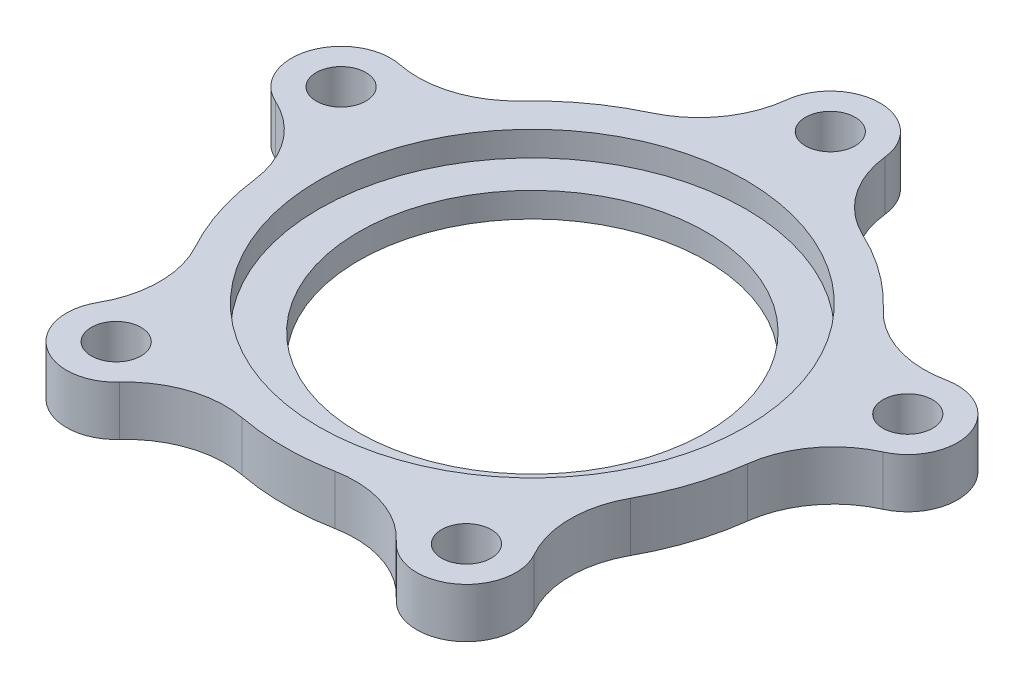
ISO-10303-21;
HEADER;
FILE_DESCRIPTION(('STEP AP214'),'2;1');
FILE_NAME('part.step','',(''),(''),'','','');
FILE_SCHEMA(('AUTOMOTIVE_DESIGN { 1 0 10303 214 1 1 1 1 }'));
ENDSEC;
DATA;
#1=APPLICATION_CONTEXT('core data for automotive mechanical design processes');
#2=APPLICATION_PROTOCOL_DEFINITION('international standard','automotive_design',2000,#1);
#3=PRODUCT_CONTEXT('',#1,'mechanical');
#4=PRODUCT('Part','Part','',(#3));
#5=PRODUCT_RELATED_PRODUCT_CATEGORY('part','',(#4));
#6=PRODUCT_DEFINITION_FORMATION('','',#4);
#7=PRODUCT_DEFINITION_CONTEXT('part definition',#1,'design');
#8=PRODUCT_DEFINITION('design','',#6,#7);
#9=PRODUCT_DEFINITION_SHAPE('','',#8);
#10=(LENGTH_UNIT() NAMED_UNIT(*) SI_UNIT(.MILLI.,.METRE.));
#11=(NAMED_UNIT(*) PLANE_ANGLE_UNIT() SI_UNIT($,.RADIAN.));
#12=(NAMED_UNIT(*) SI_UNIT($,.STERADIAN.) SOLID_ANGLE_UNIT());
#13=UNCERTAINTY_MEASURE_WITH_UNIT(LENGTH_MEASURE(1.E-05),#10,'distance_accuracy_value','');
#14=(GEOMETRIC_REPRESENTATION_CONTEXT(3) GLOBAL_UNCERTAINTY_ASSIGNED_CONTEXT((#13)) GLOBAL_UNIT_ASSIGNED_CONTEXT((#10,
#11,#12)) REPRESENTATION_CONTEXT('',''));
#15=CARTESIAN_POINT('',(0.,0.,0.));
#16=DIRECTION('',(0.,0.,1.));
#17=DIRECTION('',(1.,0.,0.));
#18=AXIS2_PLACEMENT_3D('',#15,#16,#17);
#19=CARTESIAN_POINT('',(0.,6.35,0.));
#20=DIRECTION('',(0.,-1.,0.));
#21=DIRECTION('',(0.,0.,-1.));
#22=AXIS2_PLACEMENT_3D('',#19,#20,#21);
#23=CYLINDRICAL_SURFACE('',#22,31.75);
#24=CARTESIAN_POINT('',(0.,0.,0.));
#25=DIRECTION('',(0.,1.,0.));
#26=DIRECTION('',(0.,0.,1.));
#27=AXIS2_PLACEMENT_3D('',#24,#25,#26);
#28=CIRCLE('',#27,31.75);
#29=CARTESIAN_POINT('',(-5.94458548380077,0.,31.1885299978339));
#30=VERTEX_POINT('',#29);
#31=CARTESIAN_POINT('',(5.94458548380077,0.,31.1885299978339));
#32=VERTEX_POINT('',#31);
#33=EDGE_CURVE('E238',#30,#32,#28,.T.);
#34=ORIENTED_EDGE('',*,*,#33,.T.);
#35=DIRECTION('',(0.,-1.,0.));
#36=VECTOR('',#35,1.);
#37=CARTESIAN_POINT('',(5.94458548380077,6.35,31.1885299978339));
#38=LINE('',#37,#36);
#39=CARTESIAN_POINT('',(5.94458548380077,6.35,31.1885299978339));
#40=VERTEX_POINT('',#39);
#41=EDGE_CURVE('E322',#32,#40,#38,.F.);
#42=ORIENTED_EDGE('',*,*,#41,.T.);
#43=CARTESIAN_POINT('',(0.,6.35,0.));
#44=DIRECTION('',(0.,1.,0.));
#45=DIRECTION('',(0.,0.,1.));
#46=AXIS2_PLACEMENT_3D('',#43,#44,#45);
#47=CIRCLE('',#46,31.75);
#48=CARTESIAN_POINT('',(-5.94458548380077,6.35,31.1885299978339));
#49=VERTEX_POINT('',#48);
#50=EDGE_CURVE('E293',#49,#40,#47,.T.);
#51=ORIENTED_EDGE('',*,*,#50,.F.);
#52=DIRECTION('',(0.,-1.,0.));
#53=VECTOR('',#52,1.);
#54=CARTESIAN_POINT('',(-5.94458548380077,6.35,31.1885299978339));
#55=LINE('',#54,#53);
#56=EDGE_CURVE('E319',#49,#30,#55,.T.);
#57=ORIENTED_EDGE('',*,*,#56,.T.);
#58=EDGE_LOOP('',(#34,#42,#51,#57));
#59=FACE_BOUND('',#58,.T.);
#60=ADVANCED_FACE('F53',(#59),#23,.T.);
#61=CARTESIAN_POINT('',(22.3946181123432,6.35,30.8235474856855));
#62=DIRECTION('',(0.,-1.,0.));
#63=DIRECTION('',(0.,0.,-1.));
#64=AXIS2_PLACEMENT_3D('',#61,#62,#63);
#65=CYLINDRICAL_SURFACE('',#64,6.35);
#66=CARTESIAN_POINT('',(22.3946181123432,0.,30.8235474856855));
#67=DIRECTION('',(0.,1.,0.));
#68=DIRECTION('',(0.,0.,1.));
#69=AXIS2_PLACEMENT_3D('',#66,#67,#68);
#70=CIRCLE('',#69,6.35);
#71=CARTESIAN_POINT('',(17.7038853006692,0.,35.1036789894462));
#72=VERTEX_POINT('',#71);
#73=CARTESIAN_POINT('',(27.9147812244744,0.,27.685028851765));
#74=VERTEX_POINT('',#73);
#75=EDGE_CURVE('E237',#72,#74,#70,.T.);
#76=ORIENTED_EDGE('',*,*,#75,.T.);
#77=DIRECTION('',(0.,-1.,0.));
#78=VECTOR('',#77,1.);
#79=CARTESIAN_POINT('',(27.9147812244744,6.35,27.685028851765));
#80=LINE('',#79,#78);
#81=CARTESIAN_POINT('',(27.9147812244744,6.35,27.685028851765));
#82=VERTEX_POINT('',#81);
#83=EDGE_CURVE('E316',#74,#82,#80,.F.);
#84=ORIENTED_EDGE('',*,*,#83,.T.);
#85=CARTESIAN_POINT('',(22.3946181123432,6.35,30.8235474856855));
#86=DIRECTION('',(0.,1.,0.));
#87=DIRECTION('',(0.,0.,1.));
#88=AXIS2_PLACEMENT_3D('',#85,#86,#87);
#89=CIRCLE('',#88,6.35);
#90=CARTESIAN_POINT('',(17.7038853006692,6.35,35.1036789894462));
#91=VERTEX_POINT('',#90);
#92=EDGE_CURVE('E456',#91,#82,#89,.T.);
#93=ORIENTED_EDGE('',*,*,#92,.F.);
#94=DIRECTION('',(0.,-1.,0.));
#95=VECTOR('',#94,1.);
#96=CARTESIAN_POINT('',(17.7038853006692,6.35,35.1036789894462));
#97=LINE('',#96,#95);
#98=EDGE_CURVE('E312',#91,#72,#97,.T.);
#99=ORIENTED_EDGE('',*,*,#98,.T.);
#100=EDGE_LOOP('',(#76,#84,#93,#99));
#101=FACE_BOUND('',#100,.T.);
#102=ADVANCED_FACE('F483',(#101),#65,.T.);
#103=CARTESIAN_POINT('',(27.8250767490978,0.,15.2914225599458));
#104=VERTEX_POINT('',#103);
#105=CARTESIAN_POINT('',(31.4990326271159,0.,3.98414903786122));
#106=VERTEX_POINT('',#105);
#107=EDGE_CURVE('E224',#104,#106,#28,.T.);
#108=ORIENTED_EDGE('',*,*,#107,.T.);
#109=DIRECTION('',(0.,-1.,0.));
#110=VECTOR('',#109,1.);
#111=CARTESIAN_POINT('',(31.4990326271159,6.35,3.98414903786122));
#112=LINE('',#111,#110);
#113=CARTESIAN_POINT('',(31.4990326271159,6.35,3.98414903786122));
#114=VERTEX_POINT('',#113);
#115=EDGE_CURVE('E309',#106,#114,#112,.F.);
#116=ORIENTED_EDGE('',*,*,#115,.T.);
#117=CARTESIAN_POINT('',(27.8250767490978,6.35,15.2914225599458));
#118=VERTEX_POINT('',#117);
#119=EDGE_CURVE('E450',#118,#114,#47,.T.);
#120=ORIENTED_EDGE('',*,*,#119,.F.);
#121=DIRECTION('',(0.,-1.,0.));
#122=VECTOR('',#121,1.);
#123=CARTESIAN_POINT('',(27.8250767490978,6.35,15.2914225599458));
#124=LINE('',#123,#122);
#125=EDGE_CURVE('E306',#118,#104,#124,.T.);
#126=ORIENTED_EDGE('',*,*,#125,.T.);
#127=EDGE_LOOP('',(#108,#116,#120,#126));
#128=FACE_BOUND('',#127,.T.);
#129=ADVANCED_FACE('F485',(#128),#23,.T.);
#130=CARTESIAN_POINT('',(36.2352532708454,6.35,-11.7735474856855));
#131=DIRECTION('',(0.,-1.,0.));
#132=DIRECTION('',(0.,0.,-1.));
#133=AXIS2_PLACEMENT_3D('',#130,#131,#132);
#134=CYLINDRICAL_SURFACE('',#133,6.35);
#135=CARTESIAN_POINT('',(36.2352532708454,0.,-11.7735474856855));
#136=DIRECTION('',(0.,1.,0.));
#137=DIRECTION('',(0.,0.,1.));
#138=AXIS2_PLACEMENT_3D('',#135,#136,#137);
#139=CIRCLE('',#138,6.35);
#140=CARTESIAN_POINT('',(38.8563840732176,0.,-5.98976210612177));
#141=VERTEX_POINT('',#140);
#142=CARTESIAN_POINT('',(34.9561688859118,0.,-17.9933901795339));
#143=VERTEX_POINT('',#142);
#144=EDGE_CURVE('E221',#141,#143,#139,.T.);
#145=ORIENTED_EDGE('',*,*,#144,.T.);
#146=DIRECTION('',(0.,-1.,0.));
#147=VECTOR('',#146,1.);
#148=CARTESIAN_POINT('',(34.9561688859118,6.35,-17.9933901795339));
#149=LINE('',#148,#147);
#150=CARTESIAN_POINT('',(34.9561688859118,6.35,-17.9933901795339));
#151=VERTEX_POINT('',#150);
#152=EDGE_CURVE('E196',#143,#151,#149,.F.);
#153=ORIENTED_EDGE('',*,*,#152,.T.);
#154=CARTESIAN_POINT('',(36.2352532708454,6.35,-11.7735474856855));
#155=DIRECTION('',(0.,1.,0.));
#156=DIRECTION('',(0.,0.,1.));
#157=AXIS2_PLACEMENT_3D('',#154,#155,#156);
#158=CIRCLE('',#157,6.35);
#159=CARTESIAN_POINT('',(38.8563840732176,6.35,-5.98976210612177));
#160=VERTEX_POINT('',#159);
#161=EDGE_CURVE('E449',#160,#151,#158,.T.);
#162=ORIENTED_EDGE('',*,*,#161,.F.);
#163=DIRECTION('',(0.,-1.,0.));
#164=VECTOR('',#163,1.);
#165=CARTESIAN_POINT('',(38.8563840732176,6.35,-5.98976210612177));
#166=LINE('',#165,#164);
#167=EDGE_CURVE('E212',#160,#141,#166,.T.);
#168=ORIENTED_EDGE('',*,*,#167,.T.);
#169=EDGE_LOOP('',(#145,#153,#162,#168));
#170=FACE_BOUND('',#169,.T.);
#171=ADVANCED_FACE('F495',(#170),#134,.T.);
#172=CARTESIAN_POINT('',(23.1414286543176,6.35,-21.7379111194505));
#173=VERTEX_POINT('',#172);
#174=CARTESIAN_POINT('',(13.5228872924987,6.35,-28.7261904761905));
#175=VERTEX_POINT('',#174);
#176=EDGE_CURVE('E210',#173,#175,#47,.T.);
#177=ORIENTED_EDGE('',*,*,#176,.F.);
#178=DIRECTION('',(0.,-1.,0.));
#179=VECTOR('',#178,1.);
#180=CARTESIAN_POINT('',(23.1414286543176,6.35,-21.7379111194505));
#181=LINE('',#180,#179);
#182=CARTESIAN_POINT('',(23.1414286543176,0.,-21.7379111194505));
#183=VERTEX_POINT('',#182);
#184=EDGE_CURVE('E195',#173,#183,#181,.T.);
#185=ORIENTED_EDGE('',*,*,#184,.T.);
#186=CARTESIAN_POINT('',(13.5228872924987,0.,-28.7261904761905));
#187=VERTEX_POINT('',#186);
#188=EDGE_CURVE('E208',#183,#187,#28,.T.);
#189=ORIENTED_EDGE('',*,*,#188,.T.);
#190=DIRECTION('',(0.,-1.,0.));
#191=VECTOR('',#190,1.);
#192=CARTESIAN_POINT('',(13.5228872924987,6.35,-28.7261904761905));
#193=LINE('',#192,#191);
#194=EDGE_CURVE('E213',#187,#175,#193,.F.);
#195=ORIENTED_EDGE('',*,*,#194,.T.);
#196=EDGE_LOOP('',(#177,#185,#189,#195));
#197=FACE_BOUND('',#196,.T.);
#198=ADVANCED_FACE('F207',(#197),#23,.T.);
#199=CARTESIAN_POINT('',(0.,6.35,-38.1));
#200=DIRECTION('',(0.,-1.,0.));
#201=DIRECTION('',(0.,0.,-1.));
#202=AXIS2_PLACEMENT_3D('',#199,#200,#201);
#203=CYLINDRICAL_SURFACE('',#202,6.35);
#204=CARTESIAN_POINT('',(0.,0.,-38.1));
#205=DIRECTION('',(0.,1.,0.));
#206=DIRECTION('',(0.,0.,1.));
#207=AXIS2_PLACEMENT_3D('',#204,#205,#206);
#208=CIRCLE('',#207,6.35);
#209=CARTESIAN_POINT('',(6.31068073649941,0.,-38.8055555555556));
#210=VERTEX_POINT('',#209);
#211=CARTESIAN_POINT('',(-6.31068073649941,0.,-38.8055555555556));
#212=VERTEX_POINT('',#211);
#213=EDGE_CURVE('E220',#210,#212,#208,.T.);
#214=ORIENTED_EDGE('',*,*,#213,.T.);
#215=DIRECTION('',(0.,-1.,0.));
#216=VECTOR('',#215,1.);
#217=CARTESIAN_POINT('',(-6.31068073649941,6.35,-38.8055555555556));
#218=LINE('',#217,#216);
#219=CARTESIAN_POINT('',(-6.31068073649941,6.35,-38.8055555555556));
#220=VERTEX_POINT('',#219);
#221=EDGE_CURVE('E69',#212,#220,#218,.F.);
#222=ORIENTED_EDGE('',*,*,#221,.T.);
#223=CARTESIAN_POINT('',(0.,6.35,-38.1));
#224=DIRECTION('',(0.,1.,0.));
#225=DIRECTION('',(0.,0.,1.));
#226=AXIS2_PLACEMENT_3D('',#223,#224,#225);
#227=CIRCLE('',#226,6.35);
#228=CARTESIAN_POINT('',(6.31068073649941,6.35,-38.8055555555556));
#229=VERTEX_POINT('',#228);
#230=EDGE_CURVE('E445',#229,#220,#227,.T.);
#231=ORIENTED_EDGE('',*,*,#230,.F.);
#232=DIRECTION('',(0.,-1.,0.));
#233=VECTOR('',#232,1.);
#234=CARTESIAN_POINT('',(6.31068073649941,6.35,-38.8055555555556));
#235=LINE('',#234,#233);
#236=EDGE_CURVE('E351',#229,#210,#235,.T.);
#237=ORIENTED_EDGE('',*,*,#236,.T.);
#238=EDGE_LOOP('',(#214,#222,#231,#237));
#239=FACE_BOUND('',#238,.T.);
#240=ADVANCED_FACE('F507',(#239),#203,.T.);
#241=CARTESIAN_POINT('',(-13.5228872924987,0.,-28.7261904761905));
#242=VERTEX_POINT('',#241);
#243=CARTESIAN_POINT('',(-23.1414286543176,0.,-21.7379111194505));
#244=VERTEX_POINT('',#243);
#245=EDGE_CURVE('E223',#242,#244,#28,.T.);
#246=ORIENTED_EDGE('',*,*,#245,.T.);
#247=DIRECTION('',(0.,-1.,0.));
#248=VECTOR('',#247,1.);
#249=CARTESIAN_POINT('',(-23.1414286543176,6.35,-21.7379111194505));
#250=LINE('',#249,#248);
#251=CARTESIAN_POINT('',(-23.1414286543176,6.35,-21.7379111194505));
#252=VERTEX_POINT('',#251);
#253=EDGE_CURVE('E348',#244,#252,#250,.F.);
#254=ORIENTED_EDGE('',*,*,#253,.T.);
#255=CARTESIAN_POINT('',(-13.5228872924987,6.35,-28.7261904761905));
#256=VERTEX_POINT('',#255);
#257=EDGE_CURVE('E439',#256,#252,#47,.T.);
#258=ORIENTED_EDGE('',*,*,#257,.F.);
#259=DIRECTION('',(0.,-1.,0.));
#260=VECTOR('',#259,1.);
#261=CARTESIAN_POINT('',(-13.5228872924987,6.35,-28.7261904761905));
#262=LINE('',#261,#260);
#263=EDGE_CURVE('E344',#256,#242,#262,.T.);
#264=ORIENTED_EDGE('',*,*,#263,.T.);
#265=EDGE_LOOP('',(#246,#254,#258,#264));
#266=FACE_BOUND('',#265,.T.);
#267=ADVANCED_FACE('F499',(#266),#23,.T.);
#268=CARTESIAN_POINT('',(-36.2352532708454,6.35,-11.7735474856855));
#269=DIRECTION('',(0.,-1.,0.));
#270=DIRECTION('',(0.,0.,-1.));
#271=AXIS2_PLACEMENT_3D('',#268,#269,#270);
#272=CYLINDRICAL_SURFACE('',#271,6.35);
#273=CARTESIAN_POINT('',(-36.2352532708454,0.,-11.7735474856855));
#274=DIRECTION('',(0.,1.,0.));
#275=DIRECTION('',(0.,0.,1.));
#276=AXIS2_PLACEMENT_3D('',#273,#274,#275);
#277=CIRCLE('',#276,6.35);
#278=CARTESIAN_POINT('',(-34.9561688859118,0.,-17.9933901795339));
#279=VERTEX_POINT('',#278);
#280=CARTESIAN_POINT('',(-38.8563840732176,0.,-5.98976210612175));
#281=VERTEX_POINT('',#280);
#282=EDGE_CURVE('E233',#279,#281,#277,.T.);
#283=ORIENTED_EDGE('',*,*,#282,.T.);
#284=DIRECTION('',(0.,-1.,0.));
#285=VECTOR('',#284,1.);
#286=CARTESIAN_POINT('',(-38.8563840732176,6.35,-5.98976210612175));
#287=LINE('',#286,#285);
#288=CARTESIAN_POINT('',(-38.8563840732176,6.35,-5.98976210612175));
#289=VERTEX_POINT('',#288);
#290=EDGE_CURVE('E341',#281,#289,#287,.F.);
#291=ORIENTED_EDGE('',*,*,#290,.T.);
#292=CARTESIAN_POINT('',(-36.2352532708454,6.35,-11.7735474856855));
#293=DIRECTION('',(0.,1.,0.));
#294=DIRECTION('',(0.,0.,1.));
#295=AXIS2_PLACEMENT_3D('',#292,#293,#294);
#296=CIRCLE('',#295,6.35);
#297=CARTESIAN_POINT('',(-34.9561688859118,6.35,-17.9933901795339));
#298=VERTEX_POINT('',#297);
#299=EDGE_CURVE('E437',#298,#289,#296,.T.);
#300=ORIENTED_EDGE('',*,*,#299,.F.);
#301=DIRECTION('',(0.,-1.,0.));
#302=VECTOR('',#301,1.);
#303=CARTESIAN_POINT('',(-34.9561688859118,6.35,-17.9933901795339));
#304=LINE('',#303,#302);
#305=EDGE_CURVE('E338',#298,#279,#304,.T.);
#306=ORIENTED_EDGE('',*,*,#305,.T.);
#307=EDGE_LOOP('',(#283,#291,#300,#306));
#308=FACE_BOUND('',#307,.T.);
#309=ADVANCED_FACE('F498',(#308),#272,.T.);
#310=CARTESIAN_POINT('',(-31.4990326271159,0.,3.98414903786123));
#311=VERTEX_POINT('',#310);
#312=CARTESIAN_POINT('',(-27.8250767490977,0.,15.2914225599458));
#313=VERTEX_POINT('',#312);
#314=EDGE_CURVE('E234',#311,#313,#28,.T.);
#315=ORIENTED_EDGE('',*,*,#314,.T.);
#316=DIRECTION('',(0.,-1.,0.));
#317=VECTOR('',#316,1.);
#318=CARTESIAN_POINT('',(-27.8250767490978,6.35,15.2914225599458));
#319=LINE('',#318,#317);
#320=CARTESIAN_POINT('',(-27.8250767490977,6.35,15.2914225599458));
#321=VERTEX_POINT('',#320);
#322=EDGE_CURVE('E335',#313,#321,#319,.F.);
#323=ORIENTED_EDGE('',*,*,#322,.T.);
#324=CARTESIAN_POINT('',(-31.4990326271159,6.35,3.98414903786123));
#325=VERTEX_POINT('',#324);
#326=EDGE_CURVE('E433',#325,#321,#47,.T.);
#327=ORIENTED_EDGE('',*,*,#326,.F.);
#328=DIRECTION('',(0.,-1.,0.));
#329=VECTOR('',#328,1.);
#330=CARTESIAN_POINT('',(-31.4990326271159,6.35,3.98414903786123));
#331=LINE('',#330,#329);
#332=EDGE_CURVE('E332',#325,#311,#331,.T.);
#333=ORIENTED_EDGE('',*,*,#332,.T.);
#334=EDGE_LOOP('',(#315,#323,#327,#333));
#335=FACE_BOUND('',#334,.T.);
#336=ADVANCED_FACE('F486',(#335),#23,.T.);
#337=CARTESIAN_POINT('',(-22.3946181123432,6.35,30.8235474856855));
#338=DIRECTION('',(0.,-1.,0.));
#339=DIRECTION('',(0.,0.,-1.));
#340=AXIS2_PLACEMENT_3D('',#337,#338,#339);
#341=CYLINDRICAL_SURFACE('',#340,6.35);
#342=CARTESIAN_POINT('',(-22.3946181123432,0.,30.8235474856855));
#343=DIRECTION('',(0.,1.,0.));
#344=DIRECTION('',(0.,0.,1.));
#345=AXIS2_PLACEMENT_3D('',#342,#343,#344);
#346=CIRCLE('',#345,6.35);
#347=CARTESIAN_POINT('',(-27.9147812244744,0.,27.6850288517651));
#348=VERTEX_POINT('',#347);
#349=CARTESIAN_POINT('',(-17.7038853006692,0.,35.1036789894462));
#350=VERTEX_POINT('',#349);
#351=EDGE_CURVE('E257',#348,#350,#346,.T.);
#352=ORIENTED_EDGE('',*,*,#351,.T.);
#353=DIRECTION('',(0.,-1.,0.));
#354=VECTOR('',#353,1.);
#355=CARTESIAN_POINT('',(-17.7038853006692,6.35,35.1036789894462));
#356=LINE('',#355,#354);
#357=CARTESIAN_POINT('',(-17.7038853006692,6.35,35.1036789894462));
#358=VERTEX_POINT('',#357);
#359=EDGE_CURVE('E329',#350,#358,#356,.F.);
#360=ORIENTED_EDGE('',*,*,#359,.T.);
#361=CARTESIAN_POINT('',(-22.3946181123432,6.35,30.8235474856855));
#362=DIRECTION('',(0.,1.,0.));
#363=DIRECTION('',(0.,0.,1.));
#364=AXIS2_PLACEMENT_3D('',#361,#362,#363);
#365=CIRCLE('',#364,6.35);
#366=CARTESIAN_POINT('',(-27.9147812244744,6.35,27.6850288517651));
#367=VERTEX_POINT('',#366);
#368=EDGE_CURVE('E429',#367,#358,#365,.T.);
#369=ORIENTED_EDGE('',*,*,#368,.F.);
#370=DIRECTION('',(0.,-1.,0.));
#371=VECTOR('',#370,1.);
#372=CARTESIAN_POINT('',(-27.9147812244744,6.35,27.6850288517651));
#373=LINE('',#372,#371);
#374=EDGE_CURVE('E325',#367,#348,#373,.T.);
#375=ORIENTED_EDGE('',*,*,#374,.T.);
#376=EDGE_LOOP('',(#352,#360,#369,#375));
#377=FACE_BOUND('',#376,.T.);
#378=ADVANCED_FACE('F497',(#377),#341,.T.);
#379=CARTESIAN_POINT('',(-36.2352532708454,6.35,-11.7735474856855));
#380=DIRECTION('',(0.,-1.,0.));
#381=DIRECTION('',(0.,0.,-1.));
#382=AXIS2_PLACEMENT_3D('',#379,#380,#381);
#383=CYLINDRICAL_SURFACE('',#382,3.175);
#384=CARTESIAN_POINT('',(-36.2352532708454,6.35,-11.7735474856855));
#385=DIRECTION('',(0.,1.,0.));
#386=DIRECTION('',(0.,0.,1.));
#387=AXIS2_PLACEMENT_3D('',#384,#385,#386);
#388=CIRCLE('',#387,3.175);
#389=CARTESIAN_POINT('',(-36.2352532708454,6.35,-8.59854748568549));
#390=VERTEX_POINT('',#389);
#391=EDGE_CURVE('E410',#390,#390,#388,.T.);
#392=ORIENTED_EDGE('',*,*,#391,.T.);
#393=EDGE_LOOP('',(#392));
#394=FACE_BOUND('',#393,.T.);
#395=CARTESIAN_POINT('',(-36.2352532708454,0.,-11.7735474856855));
#396=DIRECTION('',(0.,1.,0.));
#397=DIRECTION('',(0.,0.,1.));
#398=AXIS2_PLACEMENT_3D('',#395,#396,#397);
#399=CIRCLE('',#398,3.175);
#400=CARTESIAN_POINT('',(-36.2352532708454,0.,-8.59854748568549));
#401=VERTEX_POINT('',#400);
#402=EDGE_CURVE('E285',#401,#401,#399,.T.);
#403=ORIENTED_EDGE('',*,*,#402,.F.);
#404=EDGE_LOOP('',(#403));
#405=FACE_BOUND('',#404,.T.);
#406=ADVANCED_FACE('F504',(#394,#405),#383,.F.);
#407=CARTESIAN_POINT('',(0.,6.35,-38.1));
#408=DIRECTION('',(0.,-1.,0.));
#409=DIRECTION('',(0.,0.,-1.));
#410=AXIS2_PLACEMENT_3D('',#407,#408,#409);
#411=CYLINDRICAL_SURFACE('',#410,3.17500000000001);
#412=CARTESIAN_POINT('',(0.,6.35,-38.1));
#413=DIRECTION('',(0.,1.,0.));
#414=DIRECTION('',(0.,0.,1.));
#415=AXIS2_PLACEMENT_3D('',#412,#413,#414);
#416=CIRCLE('',#415,3.17500000000001);
#417=CARTESIAN_POINT('',(0.,6.35,-34.925));
#418=VERTEX_POINT('',#417);
#419=EDGE_CURVE('E413',#418,#418,#416,.T.);
#420=ORIENTED_EDGE('',*,*,#419,.T.);
#421=EDGE_LOOP('',(#420));
#422=FACE_BOUND('',#421,.T.);
#423=CARTESIAN_POINT('',(0.,0.,-38.1));
#424=DIRECTION('',(0.,1.,0.));
#425=DIRECTION('',(0.,0.,1.));
#426=AXIS2_PLACEMENT_3D('',#423,#424,#425);
#427=CIRCLE('',#426,3.17500000000001);
#428=CARTESIAN_POINT('',(0.,0.,-34.925));
#429=VERTEX_POINT('',#428);
#430=EDGE_CURVE('E281',#429,#429,#427,.T.);
#431=ORIENTED_EDGE('',*,*,#430,.F.);
#432=EDGE_LOOP('',(#431));
#433=FACE_BOUND('',#432,.T.);
#434=ADVANCED_FACE('F614',(#422,#433),#411,.F.);
#435=CARTESIAN_POINT('',(36.2352532708454,6.35,-11.7735474856855));
#436=DIRECTION('',(0.,-1.,0.));
#437=DIRECTION('',(0.,0.,-1.));
#438=AXIS2_PLACEMENT_3D('',#435,#436,#437);
#439=CYLINDRICAL_SURFACE('',#438,3.17500000000001);
#440=CARTESIAN_POINT('',(36.2352532708454,6.35,-11.7735474856855));
#441=DIRECTION('',(0.,1.,0.));
#442=DIRECTION('',(0.,0.,1.));
#443=AXIS2_PLACEMENT_3D('',#440,#441,#442);
#444=CIRCLE('',#443,3.17500000000001);
#445=CARTESIAN_POINT('',(36.2352532708454,6.35,-8.5985474856855));
#446=VERTEX_POINT('',#445);
#447=EDGE_CURVE('E417',#446,#446,#444,.T.);
#448=ORIENTED_EDGE('',*,*,#447,.T.);
#449=EDGE_LOOP('',(#448));
#450=FACE_BOUND('',#449,.T.);
#451=CARTESIAN_POINT('',(36.2352532708454,0.,-11.7735474856855));
#452=DIRECTION('',(0.,1.,0.));
#453=DIRECTION('',(0.,0.,1.));
#454=AXIS2_PLACEMENT_3D('',#451,#452,#453);
#455=CIRCLE('',#454,3.17500000000001);
#456=CARTESIAN_POINT('',(36.2352532708454,0.,-8.5985474856855));
#457=VERTEX_POINT('',#456);
#458=EDGE_CURVE('E277',#457,#457,#455,.T.);
#459=ORIENTED_EDGE('',*,*,#458,.F.);
#460=EDGE_LOOP('',(#459));
#461=FACE_BOUND('',#460,.T.);
#462=ADVANCED_FACE('F618',(#450,#461),#439,.F.);
#463=CARTESIAN_POINT('',(22.3946181123432,6.35,30.8235474856855));
#464=DIRECTION('',(0.,-1.,0.));
#465=DIRECTION('',(0.,0.,-1.));
#466=AXIS2_PLACEMENT_3D('',#463,#464,#465);
#467=CYLINDRICAL_SURFACE('',#466,3.17500000000001);
#468=CARTESIAN_POINT('',(22.3946181123432,6.35,30.8235474856855));
#469=DIRECTION('',(0.,1.,0.));
#470=DIRECTION('',(0.,0.,1.));
#471=AXIS2_PLACEMENT_3D('',#468,#469,#470);
#472=CIRCLE('',#471,3.17500000000001);
#473=CARTESIAN_POINT('',(22.3946181123432,6.35,33.9985474856855));
#474=VERTEX_POINT('',#473);
#475=EDGE_CURVE('E421',#474,#474,#472,.T.);
#476=ORIENTED_EDGE('',*,*,#475,.T.);
#477=EDGE_LOOP('',(#476));
#478=FACE_BOUND('',#477,.T.);
#479=CARTESIAN_POINT('',(22.3946181123432,0.,30.8235474856855));
#480=DIRECTION('',(0.,1.,0.));
#481=DIRECTION('',(0.,0.,1.));
#482=AXIS2_PLACEMENT_3D('',#479,#480,#481);
#483=CIRCLE('',#482,3.17500000000001);
#484=CARTESIAN_POINT('',(22.3946181123432,0.,33.9985474856855));
#485=VERTEX_POINT('',#484);
#486=EDGE_CURVE('E265',#485,#485,#483,.T.);
#487=ORIENTED_EDGE('',*,*,#486,.F.);
#488=EDGE_LOOP('',(#487));
#489=FACE_BOUND('',#488,.T.);
#490=ADVANCED_FACE('F622',(#478,#489),#467,.F.);
#491=CARTESIAN_POINT('',(0.,6.35,0.));
#492=DIRECTION('',(0.,-1.,0.));
#493=DIRECTION('',(0.,0.,-1.));
#494=AXIS2_PLACEMENT_3D('',#491,#492,#493);
#495=CYLINDRICAL_SURFACE('',#494,27.305);
#496=CARTESIAN_POINT('',(0.,3.175,0.));
#497=DIRECTION('',(0.,1.,0.));
#498=DIRECTION('',(0.,0.,1.));
#499=AXIS2_PLACEMENT_3D('',#496,#497,#498);
#500=CIRCLE('',#499,27.305);
#501=CARTESIAN_POINT('',(0.,3.175,27.305));
#502=VERTEX_POINT('',#501);
#503=EDGE_CURVE('E294',#502,#502,#500,.T.);
#504=ORIENTED_EDGE('',*,*,#503,.F.);
#505=EDGE_LOOP('',(#504));
#506=FACE_BOUND('',#505,.T.);
#507=CARTESIAN_POINT('',(0.,6.35,0.));
#508=DIRECTION('',(0.,1.,0.));
#509=DIRECTION('',(0.,0.,1.));
#510=AXIS2_PLACEMENT_3D('',#507,#508,#509);
#511=CIRCLE('',#510,27.305);
#512=CARTESIAN_POINT('',(0.,6.35,27.305));
#513=VERTEX_POINT('',#512);
#514=EDGE_CURVE('E425',#513,#513,#511,.T.);
#515=ORIENTED_EDGE('',*,*,#514,.T.);
#516=EDGE_LOOP('',(#515));
#517=FACE_BOUND('',#516,.T.);
#518=ADVANCED_FACE('F603',(#506,#517),#495,.F.);
#519=CARTESIAN_POINT('',(-22.3946181123432,6.35,30.8235474856855));
#520=DIRECTION('',(0.,-1.,0.));
#521=DIRECTION('',(0.,0.,-1.));
#522=AXIS2_PLACEMENT_3D('',#519,#520,#521);
#523=CYLINDRICAL_SURFACE('',#522,3.175);
#524=CARTESIAN_POINT('',(-22.3946181123432,6.35,30.8235474856855));
#525=DIRECTION('',(0.,1.,0.));
#526=DIRECTION('',(0.,0.,1.));
#527=AXIS2_PLACEMENT_3D('',#524,#525,#526);
#528=CIRCLE('',#527,3.175);
#529=CARTESIAN_POINT('',(-22.3946181123432,6.35,33.9985474856855));
#530=VERTEX_POINT('',#529);
#531=EDGE_CURVE('E298',#530,#530,#528,.T.);
#532=ORIENTED_EDGE('',*,*,#531,.T.);
#533=EDGE_LOOP('',(#532));
#534=FACE_BOUND('',#533,.T.);
#535=CARTESIAN_POINT('',(-22.3946181123432,0.,30.8235474856855));
#536=DIRECTION('',(0.,1.,0.));
#537=DIRECTION('',(0.,0.,1.));
#538=AXIS2_PLACEMENT_3D('',#535,#536,#537);
#539=CIRCLE('',#538,3.175);
#540=CARTESIAN_POINT('',(-22.3946181123432,0.,33.9985474856855));
#541=VERTEX_POINT('',#540);
#542=EDGE_CURVE('E289',#541,#541,#539,.T.);
#543=ORIENTED_EDGE('',*,*,#542,.F.);
#544=EDGE_LOOP('',(#543));
#545=FACE_BOUND('',#544,.T.);
#546=ADVANCED_FACE('F587',(#534,#545),#523,.F.);
#547=CARTESIAN_POINT('',(0.,6.35,0.));
#548=DIRECTION('',(0.,1.,0.));
#549=DIRECTION('',(0.,0.,1.));
#550=AXIS2_PLACEMENT_3D('',#547,#548,#549);
#551=PLANE('',#550);
#552=ORIENTED_EDGE('',*,*,#368,.T.);
#553=CARTESIAN_POINT('',(-8.32241967732108,6.35,43.6639419969675));
#554=DIRECTION('',(0.,1.,0.));
#555=DIRECTION('',(0.,0.,1.));
#556=AXIS2_PLACEMENT_3D('',#553,#554,#555);
#557=CIRCLE('',#556,12.7);
#558=EDGE_CURVE('E380',#358,#49,#557,.F.);
#559=ORIENTED_EDGE('',*,*,#558,.T.);
#560=ORIENTED_EDGE('',*,*,#50,.T.);
#561=CARTESIAN_POINT('',(8.32241967732108,6.35,43.6639419969675));
#562=DIRECTION('',(0.,1.,0.));
#563=DIRECTION('',(0.,0.,1.));
#564=AXIS2_PLACEMENT_3D('',#561,#562,#563);
#565=CIRCLE('',#564,12.7);
#566=EDGE_CURVE('E374',#40,#91,#565,.F.);
#567=ORIENTED_EDGE('',*,*,#566,.T.);
#568=ORIENTED_EDGE('',*,*,#92,.T.);
#569=CARTESIAN_POINT('',(38.9551074487369,6.35,21.4079915839241));
#570=DIRECTION('',(0.,1.,0.));
#571=DIRECTION('',(0.,0.,1.));
#572=AXIS2_PLACEMENT_3D('',#569,#570,#571);
#573=CIRCLE('',#572,12.7);
#574=EDGE_CURVE('E368',#82,#118,#573,.F.);
#575=ORIENTED_EDGE('',*,*,#574,.T.);
#576=ORIENTED_EDGE('',*,*,#119,.T.);
#577=CARTESIAN_POINT('',(44.0986456779622,6.35,5.57780865300571));
#578=DIRECTION('',(0.,1.,0.));
#579=DIRECTION('',(0.,0.,1.));
#580=AXIS2_PLACEMENT_3D('',#577,#578,#579);
#581=CIRCLE('',#580,12.7);
#582=EDGE_CURVE('E362',#114,#160,#581,.F.);
#583=ORIENTED_EDGE('',*,*,#582,.T.);
#584=ORIENTED_EDGE('',*,*,#161,.T.);
#585=CARTESIAN_POINT('',(32.3980001160446,6.35,-30.4330755672307));
#586=DIRECTION('',(0.,1.,0.));
#587=DIRECTION('',(0.,0.,1.));
#588=AXIS2_PLACEMENT_3D('',#585,#586,#587);
#589=CIRCLE('',#588,12.7);
#590=EDGE_CURVE('E202',#151,#173,#589,.F.);
#591=ORIENTED_EDGE('',*,*,#590,.T.);
#592=ORIENTED_EDGE('',*,*,#176,.T.);
#593=CARTESIAN_POINT('',(18.9320422094982,6.35,-40.2166666666667));
#594=DIRECTION('',(0.,1.,0.));
#595=DIRECTION('',(0.,0.,1.));
#596=AXIS2_PLACEMENT_3D('',#593,#594,#595);
#597=CIRCLE('',#596,12.7);
#598=EDGE_CURVE('E12',#175,#229,#597,.F.);
#599=ORIENTED_EDGE('',*,*,#598,.T.);
#600=ORIENTED_EDGE('',*,*,#230,.T.);
#601=CARTESIAN_POINT('',(-18.9320422094982,6.35,-40.2166666666667));
#602=DIRECTION('',(0.,1.,0.));
#603=DIRECTION('',(0.,0.,1.));
#604=AXIS2_PLACEMENT_3D('',#601,#602,#603);
#605=CIRCLE('',#604,12.7);
#606=EDGE_CURVE('E404',#220,#256,#605,.F.);
#607=ORIENTED_EDGE('',*,*,#606,.T.);
#608=ORIENTED_EDGE('',*,*,#257,.T.);
#609=CARTESIAN_POINT('',(-32.3980001160447,6.35,-30.4330755672306));
#610=DIRECTION('',(0.,1.,0.));
#611=DIRECTION('',(0.,0.,1.));
#612=AXIS2_PLACEMENT_3D('',#609,#610,#611);
#613=CIRCLE('',#612,12.7);
#614=EDGE_CURVE('E398',#252,#298,#613,.F.);
#615=ORIENTED_EDGE('',*,*,#614,.T.);
#616=ORIENTED_EDGE('',*,*,#299,.T.);
#617=CARTESIAN_POINT('',(-44.0986456779622,6.35,5.57780865300573));
#618=DIRECTION('',(0.,1.,0.));
#619=DIRECTION('',(0.,0.,1.));
#620=AXIS2_PLACEMENT_3D('',#617,#618,#619);
#621=CIRCLE('',#620,12.7);
#622=EDGE_CURVE('E392',#289,#325,#621,.F.);
#623=ORIENTED_EDGE('',*,*,#622,.T.);
#624=ORIENTED_EDGE('',*,*,#326,.T.);
#625=CARTESIAN_POINT('',(-38.9551074487369,6.35,21.4079915839242));
#626=DIRECTION('',(0.,1.,0.));
#627=DIRECTION('',(0.,0.,1.));
#628=AXIS2_PLACEMENT_3D('',#625,#626,#627);
#629=CIRCLE('',#628,12.7);
#630=EDGE_CURVE('E386',#321,#367,#629,.F.);
#631=ORIENTED_EDGE('',*,*,#630,.T.);
#632=EDGE_LOOP('',(#552,#559,#560,#567,#568,#575,#576,#583,#584,#591,#592,#599,#600,#607,#608,
#615,#616,#623,#624,#631));
#633=FACE_BOUND('',#632,.T.);
#634=ORIENTED_EDGE('',*,*,#514,.F.);
#635=EDGE_LOOP('',(#634));
#636=FACE_BOUND('',#635,.T.);
#637=ORIENTED_EDGE('',*,*,#475,.F.);
#638=EDGE_LOOP('',(#637));
#639=FACE_BOUND('',#638,.T.);
#640=ORIENTED_EDGE('',*,*,#447,.F.);
#641=EDGE_LOOP('',(#640));
#642=FACE_BOUND('',#641,.T.);
#643=ORIENTED_EDGE('',*,*,#419,.F.);
#644=EDGE_LOOP('',(#643));
#645=FACE_BOUND('',#644,.T.);
#646=ORIENTED_EDGE('',*,*,#391,.F.);
#647=EDGE_LOOP('',(#646));
#648=FACE_BOUND('',#647,.T.);
#649=ORIENTED_EDGE('',*,*,#531,.F.);
#650=EDGE_LOOP('',(#649));
#651=FACE_BOUND('',#650,.T.);
#652=ADVANCED_FACE('F558',(#633,#636,#639,#642,#645,#648,#651),#551,.T.);
#653=CARTESIAN_POINT('',(0.,0.,0.));
#654=DIRECTION('',(0.,1.,0.));
#655=DIRECTION('',(0.,0.,1.));
#656=AXIS2_PLACEMENT_3D('',#653,#654,#655);
#657=PLANE('',#656);
#658=ORIENTED_EDGE('',*,*,#33,.F.);
#659=CARTESIAN_POINT('',(-8.32241967732108,0.,43.6639419969675));
#660=DIRECTION('',(0.,1.,0.));
#661=DIRECTION('',(0.,0.,1.));
#662=AXIS2_PLACEMENT_3D('',#659,#660,#661);
#663=CIRCLE('',#662,12.7);
#664=EDGE_CURVE('E377',#30,#350,#663,.T.);
#665=ORIENTED_EDGE('',*,*,#664,.T.);
#666=ORIENTED_EDGE('',*,*,#351,.F.);
#667=CARTESIAN_POINT('',(-38.9551074487369,0.,21.4079915839242));
#668=DIRECTION('',(0.,1.,0.));
#669=DIRECTION('',(0.,0.,1.));
#670=AXIS2_PLACEMENT_3D('',#667,#668,#669);
#671=CIRCLE('',#670,12.7);
#672=EDGE_CURVE('E383',#348,#313,#671,.T.);
#673=ORIENTED_EDGE('',*,*,#672,.T.);
#674=ORIENTED_EDGE('',*,*,#314,.F.);
#675=CARTESIAN_POINT('',(-44.0986456779622,0.,5.57780865300573));
#676=DIRECTION('',(0.,1.,0.));
#677=DIRECTION('',(0.,0.,1.));
#678=AXIS2_PLACEMENT_3D('',#675,#676,#677);
#679=CIRCLE('',#678,12.7);
#680=EDGE_CURVE('E389',#311,#281,#679,.T.);
#681=ORIENTED_EDGE('',*,*,#680,.T.);
#682=ORIENTED_EDGE('',*,*,#282,.F.);
#683=CARTESIAN_POINT('',(-32.3980001160447,0.,-30.4330755672306));
#684=DIRECTION('',(0.,1.,0.));
#685=DIRECTION('',(0.,0.,1.));
#686=AXIS2_PLACEMENT_3D('',#683,#684,#685);
#687=CIRCLE('',#686,12.7);
#688=EDGE_CURVE('E395',#279,#244,#687,.T.);
#689=ORIENTED_EDGE('',*,*,#688,.T.);
#690=ORIENTED_EDGE('',*,*,#245,.F.);
#691=CARTESIAN_POINT('',(-18.9320422094982,0.,-40.2166666666667));
#692=DIRECTION('',(0.,1.,0.));
#693=DIRECTION('',(0.,0.,1.));
#694=AXIS2_PLACEMENT_3D('',#691,#692,#693);
#695=CIRCLE('',#694,12.7);
#696=EDGE_CURVE('E401',#242,#212,#695,.T.);
#697=ORIENTED_EDGE('',*,*,#696,.T.);
#698=ORIENTED_EDGE('',*,*,#213,.F.);
#699=CARTESIAN_POINT('',(18.9320422094982,0.,-40.2166666666667));
#700=DIRECTION('',(0.,1.,0.));
#701=DIRECTION('',(0.,0.,1.));
#702=AXIS2_PLACEMENT_3D('',#699,#700,#701);
#703=CIRCLE('',#702,12.7);
#704=EDGE_CURVE('E62',#210,#187,#703,.T.);
#705=ORIENTED_EDGE('',*,*,#704,.T.);
#706=ORIENTED_EDGE('',*,*,#188,.F.);
#707=CARTESIAN_POINT('',(32.3980001160446,0.,-30.4330755672307));
#708=DIRECTION('',(0.,1.,0.));
#709=DIRECTION('',(0.,0.,1.));
#710=AXIS2_PLACEMENT_3D('',#707,#708,#709);
#711=CIRCLE('',#710,12.7);
#712=EDGE_CURVE('E191',#183,#143,#711,.T.);
#713=ORIENTED_EDGE('',*,*,#712,.T.);
#714=ORIENTED_EDGE('',*,*,#144,.F.);
#715=CARTESIAN_POINT('',(44.0986456779622,0.,5.57780865300571));
#716=DIRECTION('',(0.,1.,0.));
#717=DIRECTION('',(0.,0.,1.));
#718=AXIS2_PLACEMENT_3D('',#715,#716,#717);
#719=CIRCLE('',#718,12.7);
#720=EDGE_CURVE('E359',#141,#106,#719,.T.);
#721=ORIENTED_EDGE('',*,*,#720,.T.);
#722=ORIENTED_EDGE('',*,*,#107,.F.);
#723=CARTESIAN_POINT('',(38.9551074487369,0.,21.4079915839241));
#724=DIRECTION('',(0.,1.,0.));
#725=DIRECTION('',(0.,0.,1.));
#726=AXIS2_PLACEMENT_3D('',#723,#724,#725);
#727=CIRCLE('',#726,12.7);
#728=EDGE_CURVE('E365',#104,#74,#727,.T.);
#729=ORIENTED_EDGE('',*,*,#728,.T.);
#730=ORIENTED_EDGE('',*,*,#75,.F.);
#731=CARTESIAN_POINT('',(8.32241967732108,0.,43.6639419969675));
#732=DIRECTION('',(0.,1.,0.));
#733=DIRECTION('',(0.,0.,1.));
#734=AXIS2_PLACEMENT_3D('',#731,#732,#733);
#735=CIRCLE('',#734,12.7);
#736=EDGE_CURVE('E371',#72,#32,#735,.T.);
#737=ORIENTED_EDGE('',*,*,#736,.T.);
#738=EDGE_LOOP('',(#658,#665,#666,#673,#674,#681,#682,#689,#690,#697,#698,#705,#706,#713,#714,
#721,#722,#729,#730,#737));
#739=FACE_BOUND('',#738,.T.);
#740=ORIENTED_EDGE('',*,*,#486,.T.);
#741=EDGE_LOOP('',(#740));
#742=FACE_BOUND('',#741,.T.);
#743=ORIENTED_EDGE('',*,*,#458,.T.);
#744=EDGE_LOOP('',(#743));
#745=FACE_BOUND('',#744,.T.);
#746=ORIENTED_EDGE('',*,*,#430,.T.);
#747=EDGE_LOOP('',(#746));
#748=FACE_BOUND('',#747,.T.);
#749=ORIENTED_EDGE('',*,*,#402,.T.);
#750=EDGE_LOOP('',(#749));
#751=FACE_BOUND('',#750,.T.);
#752=ORIENTED_EDGE('',*,*,#542,.T.);
#753=EDGE_LOOP('',(#752));
#754=FACE_BOUND('',#753,.T.);
#755=CARTESIAN_POINT('',(0.,0.,0.));
#756=DIRECTION('',(0.,1.,0.));
#757=DIRECTION('',(0.,0.,1.));
#758=AXIS2_PLACEMENT_3D('',#755,#756,#757);
#759=CIRCLE('',#758,22.225);
#760=CARTESIAN_POINT('',(0.,0.,22.225));
#761=VERTEX_POINT('',#760);
#762=EDGE_CURVE('E253',#761,#761,#759,.T.);
#763=ORIENTED_EDGE('',*,*,#762,.T.);
#764=EDGE_LOOP('',(#763));
#765=FACE_BOUND('',#764,.T.);
#766=ADVANCED_FACE('F216',(#739,#742,#745,#748,#751,#754,#765),#657,.F.);
#767=CARTESIAN_POINT('',(0.,3.175,0.));
#768=DIRECTION('',(0.,1.,0.));
#769=DIRECTION('',(0.,0.,1.));
#770=AXIS2_PLACEMENT_3D('',#767,#768,#769);
#771=PLANE('',#770);
#772=ORIENTED_EDGE('',*,*,#503,.T.);
#773=EDGE_LOOP('',(#772));
#774=FACE_BOUND('',#773,.T.);
#775=CARTESIAN_POINT('',(0.,3.175,0.));
#776=DIRECTION('',(0.,1.,0.));
#777=DIRECTION('',(0.,0.,1.));
#778=AXIS2_PLACEMENT_3D('',#775,#776,#777);
#779=CIRCLE('',#778,22.225);
#780=CARTESIAN_POINT('',(0.,3.175,22.225));
#781=VERTEX_POINT('',#780);
#782=EDGE_CURVE('E247',#781,#781,#779,.T.);
#783=ORIENTED_EDGE('',*,*,#782,.F.);
#784=EDGE_LOOP('',(#783));
#785=FACE_BOUND('',#784,.T.);
#786=ADVANCED_FACE('F471',(#774,#785),#771,.T.);
#787=CARTESIAN_POINT('',(0.,3.175,0.));
#788=DIRECTION('',(0.,-1.,0.));
#789=DIRECTION('',(0.,0.,-1.));
#790=AXIS2_PLACEMENT_3D('',#787,#788,#789);
#791=CYLINDRICAL_SURFACE('',#790,22.225);
#792=ORIENTED_EDGE('',*,*,#782,.T.);
#793=EDGE_LOOP('',(#792));
#794=FACE_BOUND('',#793,.T.);
#795=ORIENTED_EDGE('',*,*,#762,.F.);
#796=EDGE_LOOP('',(#795));
#797=FACE_BOUND('',#796,.T.);
#798=ADVANCED_FACE('F469',(#794,#797),#791,.F.);
#799=CARTESIAN_POINT('',(32.3980001160446,6.35,-30.4330755672307));
#800=DIRECTION('',(0.,1.,0.));
#801=DIRECTION('',(0.,0.,1.));
#802=AXIS2_PLACEMENT_3D('',#799,#800,#801);
#803=CYLINDRICAL_SURFACE('',#802,12.7);
#804=ORIENTED_EDGE('',*,*,#590,.F.);
#805=ORIENTED_EDGE('',*,*,#152,.F.);
#806=ORIENTED_EDGE('',*,*,#712,.F.);
#807=ORIENTED_EDGE('',*,*,#184,.F.);
#808=EDGE_LOOP('',(#804,#805,#806,#807));
#809=FACE_BOUND('',#808,.T.);
#810=ADVANCED_FACE('F194',(#809),#803,.F.);
#811=CARTESIAN_POINT('',(44.0986456779622,6.35,5.57780865300571));
#812=DIRECTION('',(0.,1.,0.));
#813=DIRECTION('',(0.,0.,1.));
#814=AXIS2_PLACEMENT_3D('',#811,#812,#813);
#815=CYLINDRICAL_SURFACE('',#814,12.7);
#816=ORIENTED_EDGE('',*,*,#582,.F.);
#817=ORIENTED_EDGE('',*,*,#115,.F.);
#818=ORIENTED_EDGE('',*,*,#720,.F.);
#819=ORIENTED_EDGE('',*,*,#167,.F.);
#820=EDGE_LOOP('',(#816,#817,#818,#819));
#821=FACE_BOUND('',#820,.T.);
#822=ADVANCED_FACE('F478',(#821),#815,.F.);
#823=CARTESIAN_POINT('',(38.9551074487369,6.35,21.4079915839241));
#824=DIRECTION('',(0.,1.,0.));
#825=DIRECTION('',(0.,0.,1.));
#826=AXIS2_PLACEMENT_3D('',#823,#824,#825);
#827=CYLINDRICAL_SURFACE('',#826,12.7);
#828=ORIENTED_EDGE('',*,*,#574,.F.);
#829=ORIENTED_EDGE('',*,*,#83,.F.);
#830=ORIENTED_EDGE('',*,*,#728,.F.);
#831=ORIENTED_EDGE('',*,*,#125,.F.);
#832=EDGE_LOOP('',(#828,#829,#830,#831));
#833=FACE_BOUND('',#832,.T.);
#834=ADVANCED_FACE('F524',(#833),#827,.F.);
#835=CARTESIAN_POINT('',(8.32241967732108,6.35,43.6639419969675));
#836=DIRECTION('',(0.,1.,0.));
#837=DIRECTION('',(0.,0.,1.));
#838=AXIS2_PLACEMENT_3D('',#835,#836,#837);
#839=CYLINDRICAL_SURFACE('',#838,12.7);
#840=ORIENTED_EDGE('',*,*,#566,.F.);
#841=ORIENTED_EDGE('',*,*,#41,.F.);
#842=ORIENTED_EDGE('',*,*,#736,.F.);
#843=ORIENTED_EDGE('',*,*,#98,.F.);
#844=EDGE_LOOP('',(#840,#841,#842,#843));
#845=FACE_BOUND('',#844,.T.);
#846=ADVANCED_FACE('F528',(#845),#839,.F.);
#847=CARTESIAN_POINT('',(-8.32241967732108,6.35,43.6639419969675));
#848=DIRECTION('',(0.,1.,0.));
#849=DIRECTION('',(0.,0.,1.));
#850=AXIS2_PLACEMENT_3D('',#847,#848,#849);
#851=CYLINDRICAL_SURFACE('',#850,12.7);
#852=ORIENTED_EDGE('',*,*,#558,.F.);
#853=ORIENTED_EDGE('',*,*,#359,.F.);
#854=ORIENTED_EDGE('',*,*,#664,.F.);
#855=ORIENTED_EDGE('',*,*,#56,.F.);
#856=EDGE_LOOP('',(#852,#853,#854,#855));
#857=FACE_BOUND('',#856,.T.);
#858=ADVANCED_FACE('F532',(#857),#851,.F.);
#859=CARTESIAN_POINT('',(-38.9551074487369,6.35,21.4079915839242));
#860=DIRECTION('',(0.,1.,0.));
#861=DIRECTION('',(0.,0.,1.));
#862=AXIS2_PLACEMENT_3D('',#859,#860,#861);
#863=CYLINDRICAL_SURFACE('',#862,12.7);
#864=ORIENTED_EDGE('',*,*,#630,.F.);
#865=ORIENTED_EDGE('',*,*,#322,.F.);
#866=ORIENTED_EDGE('',*,*,#672,.F.);
#867=ORIENTED_EDGE('',*,*,#374,.F.);
#868=EDGE_LOOP('',(#864,#865,#866,#867));
#869=FACE_BOUND('',#868,.T.);
#870=ADVANCED_FACE('F536',(#869),#863,.F.);
#871=CARTESIAN_POINT('',(-44.0986456779622,6.35,5.57780865300573));
#872=DIRECTION('',(0.,1.,0.));
#873=DIRECTION('',(0.,0.,1.));
#874=AXIS2_PLACEMENT_3D('',#871,#872,#873);
#875=CYLINDRICAL_SURFACE('',#874,12.7);
#876=ORIENTED_EDGE('',*,*,#622,.F.);
#877=ORIENTED_EDGE('',*,*,#290,.F.);
#878=ORIENTED_EDGE('',*,*,#680,.F.);
#879=ORIENTED_EDGE('',*,*,#332,.F.);
#880=EDGE_LOOP('',(#876,#877,#878,#879));
#881=FACE_BOUND('',#880,.T.);
#882=ADVANCED_FACE('F540',(#881),#875,.F.);
#883=CARTESIAN_POINT('',(-32.3980001160447,6.35,-30.4330755672306));
#884=DIRECTION('',(0.,1.,0.));
#885=DIRECTION('',(0.,0.,1.));
#886=AXIS2_PLACEMENT_3D('',#883,#884,#885);
#887=CYLINDRICAL_SURFACE('',#886,12.7);
#888=ORIENTED_EDGE('',*,*,#614,.F.);
#889=ORIENTED_EDGE('',*,*,#253,.F.);
#890=ORIENTED_EDGE('',*,*,#688,.F.);
#891=ORIENTED_EDGE('',*,*,#305,.F.);
#892=EDGE_LOOP('',(#888,#889,#890,#891));
#893=FACE_BOUND('',#892,.T.);
#894=ADVANCED_FACE('F544',(#893),#887,.F.);
#895=CARTESIAN_POINT('',(-18.9320422094982,6.35,-40.2166666666667));
#896=DIRECTION('',(0.,1.,0.));
#897=DIRECTION('',(0.,0.,1.));
#898=AXIS2_PLACEMENT_3D('',#895,#896,#897);
#899=CYLINDRICAL_SURFACE('',#898,12.7);
#900=ORIENTED_EDGE('',*,*,#606,.F.);
#901=ORIENTED_EDGE('',*,*,#221,.F.);
#902=ORIENTED_EDGE('',*,*,#696,.F.);
#903=ORIENTED_EDGE('',*,*,#263,.F.);
#904=EDGE_LOOP('',(#900,#901,#902,#903));
#905=FACE_BOUND('',#904,.T.);
#906=ADVANCED_FACE('F547',(#905),#899,.F.);
#907=CARTESIAN_POINT('',(18.9320422094982,6.35,-40.2166666666667));
#908=DIRECTION('',(0.,1.,0.));
#909=DIRECTION('',(0.,0.,1.));
#910=AXIS2_PLACEMENT_3D('',#907,#908,#909);
#911=CYLINDRICAL_SURFACE('',#910,12.7);
#912=ORIENTED_EDGE('',*,*,#598,.F.);
#913=ORIENTED_EDGE('',*,*,#194,.F.);
#914=ORIENTED_EDGE('',*,*,#704,.F.);
#915=ORIENTED_EDGE('',*,*,#236,.F.);
#916=EDGE_LOOP('',(#912,#913,#914,#915));
#917=FACE_BOUND('',#916,.T.);
#918=ADVANCED_FACE('F55',(#917),#911,.F.);
#919=CLOSED_SHELL('',(#60,#102,#129,#171,#198,#240,#267,#309,#336,#378,#406,#434,#462,#490,#518,
#546,#652,#766,#786,#798,#810,#822,#834,#846,#858,#870,#882,#894,#906,#918));
#920=MANIFOLD_SOLID_BREP('B2',#919);
#921=ADVANCED_BREP_SHAPE_REPRESENTATION('',(#18,#920),#14);
#922=SHAPE_DEFINITION_REPRESENTATION(#9,#921);
ENDSEC;
END-ISO-10303-21;
